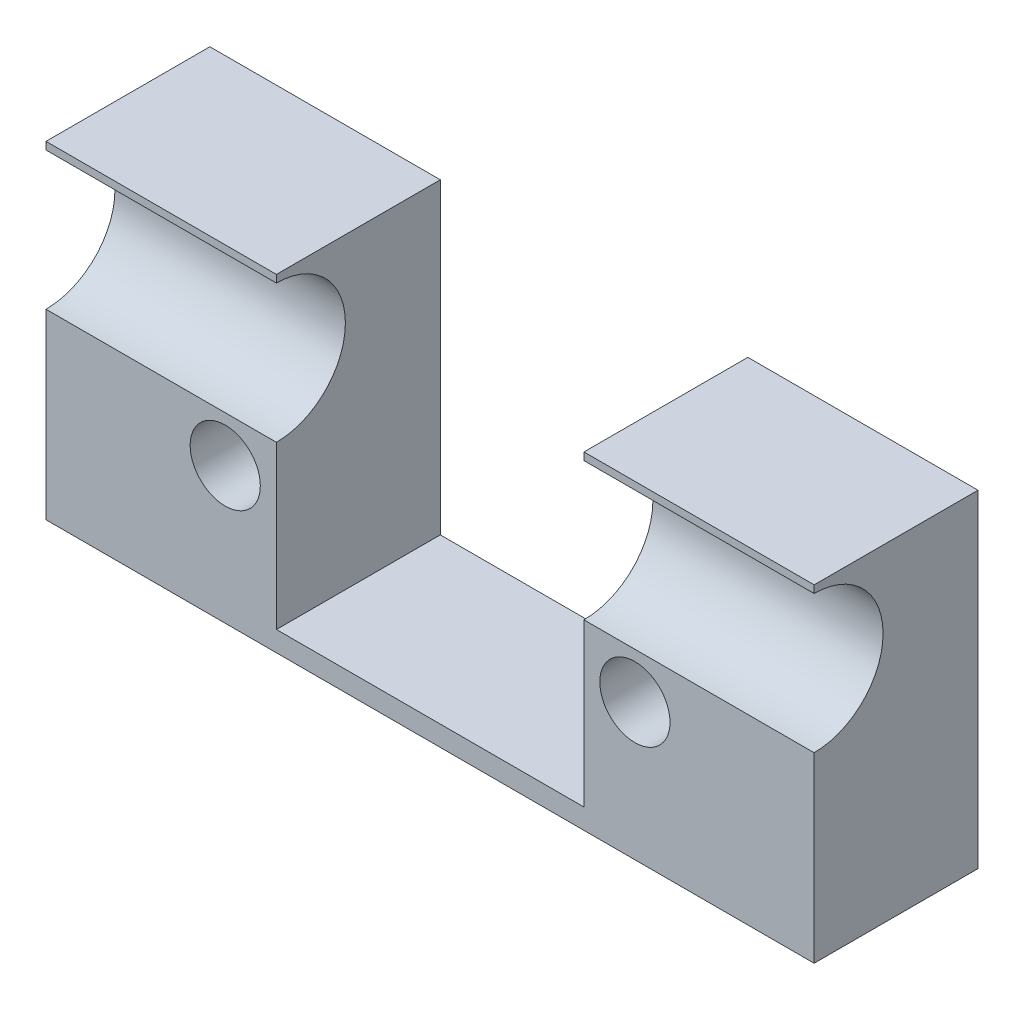
ISO-10303-21;
HEADER;
FILE_DESCRIPTION(('STEP AP214'),'2;1');
FILE_NAME('part.step','',(''),(''),'','','');
FILE_SCHEMA(('AUTOMOTIVE_DESIGN { 1 0 10303 214 1 1 1 1 }'));
ENDSEC;
DATA;
#1=APPLICATION_CONTEXT('core data for automotive mechanical design processes');
#2=APPLICATION_PROTOCOL_DEFINITION('international standard','automotive_design',2000,#1);
#3=PRODUCT_CONTEXT('',#1,'mechanical');
#4=PRODUCT('Part','Part','',(#3));
#5=PRODUCT_RELATED_PRODUCT_CATEGORY('part','',(#4));
#6=PRODUCT_DEFINITION_FORMATION('','',#4);
#7=PRODUCT_DEFINITION_CONTEXT('part definition',#1,'design');
#8=PRODUCT_DEFINITION('design','',#6,#7);
#9=PRODUCT_DEFINITION_SHAPE('','',#8);
#10=(LENGTH_UNIT() NAMED_UNIT(*) SI_UNIT(.MILLI.,.METRE.));
#11=(NAMED_UNIT(*) PLANE_ANGLE_UNIT() SI_UNIT($,.RADIAN.));
#12=(NAMED_UNIT(*) SI_UNIT($,.STERADIAN.) SOLID_ANGLE_UNIT());
#13=UNCERTAINTY_MEASURE_WITH_UNIT(LENGTH_MEASURE(1.E-05),#10,'distance_accuracy_value','');
#14=(GEOMETRIC_REPRESENTATION_CONTEXT(3) GLOBAL_UNCERTAINTY_ASSIGNED_CONTEXT((#13)) GLOBAL_UNIT_ASSIGNED_CONTEXT((#10,
#11,#12)) REPRESENTATION_CONTEXT('',''));
#15=CARTESIAN_POINT('',(0.,0.,0.));
#16=DIRECTION('',(0.,0.,1.));
#17=DIRECTION('',(1.,0.,0.));
#18=AXIS2_PLACEMENT_3D('',#15,#16,#17);
#19=CARTESIAN_POINT('',(0.,0.,0.));
#20=DIRECTION('',(0.,0.,1.));
#21=DIRECTION('',(1.,0.,0.));
#22=AXIS2_PLACEMENT_3D('',#19,#20,#21);
#23=PLANE('',#22);
#24=DIRECTION('',(0.,-1.,0.));
#25=VECTOR('',#24,1.);
#26=CARTESIAN_POINT('',(35.71875,0.,0.));
#27=LINE('',#26,#25);
#28=CARTESIAN_POINT('',(35.71875,30.48,0.));
#29=VERTEX_POINT('',#28);
#30=CARTESIAN_POINT('',(35.71875,29.7794062900681,0.));
#31=VERTEX_POINT('',#30);
#32=EDGE_CURVE('E210',#29,#31,#27,.T.);
#33=ORIENTED_EDGE('',*,*,#32,.F.);
#34=DIRECTION('',(-1.,0.,0.));
#35=VECTOR('',#34,1.);
#36=CARTESIAN_POINT('',(0.,30.48,0.));
#37=LINE('',#36,#35);
#38=CARTESIAN_POINT('',(14.3129,30.48,0.));
#39=VERTEX_POINT('',#38);
#40=EDGE_CURVE('E218',#29,#39,#37,.T.);
#41=ORIENTED_EDGE('',*,*,#40,.T.);
#42=DIRECTION('',(0.,-1.,0.));
#43=VECTOR('',#42,1.);
#44=CARTESIAN_POINT('',(14.3129,30.48,0.));
#45=LINE('',#44,#43);
#46=CARTESIAN_POINT('',(14.3129,29.7794062900681,0.));
#47=VERTEX_POINT('',#46);
#48=EDGE_CURVE('E222',#39,#47,#45,.T.);
#49=ORIENTED_EDGE('',*,*,#48,.T.);
#50=DIRECTION('',(1.,0.,0.));
#51=VECTOR('',#50,1.);
#52=CARTESIAN_POINT('',(-38.4492499999999,29.7794062900681,0.));
#53=LINE('',#52,#51);
#54=EDGE_CURVE('E157',#47,#31,#53,.T.);
#55=ORIENTED_EDGE('',*,*,#54,.T.);
#56=EDGE_LOOP('',(#33,#41,#49,#55));
#57=FACE_BOUND('',#56,.T.);
#58=ADVANCED_FACE('F40',(#57),#23,.T.);
#59=DIRECTION('',(0.,1.,0.));
#60=VECTOR('',#59,1.);
#61=CARTESIAN_POINT('',(-14.2875,30.48,0.));
#62=LINE('',#61,#60);
#63=CARTESIAN_POINT('',(-14.2875,29.7794062900681,0.));
#64=VERTEX_POINT('',#63);
#65=CARTESIAN_POINT('',(-14.2875,30.48,0.));
#66=VERTEX_POINT('',#65);
#67=EDGE_CURVE('E135',#64,#66,#62,.T.);
#68=ORIENTED_EDGE('',*,*,#67,.T.);
#69=DIRECTION('',(-1.,0.,0.));
#70=VECTOR('',#69,1.);
#71=CARTESIAN_POINT('',(0.,30.48,0.));
#72=LINE('',#71,#70);
#73=CARTESIAN_POINT('',(-35.71875,30.48,0.));
#74=VERTEX_POINT('',#73);
#75=EDGE_CURVE('E212',#66,#74,#72,.T.);
#76=ORIENTED_EDGE('',*,*,#75,.T.);
#77=DIRECTION('',(0.,-1.,0.));
#78=VECTOR('',#77,1.);
#79=CARTESIAN_POINT('',(-35.71875,30.48,0.));
#80=LINE('',#79,#78);
#81=CARTESIAN_POINT('',(-35.71875,29.7794062900681,0.));
#82=VERTEX_POINT('',#81);
#83=EDGE_CURVE('E215',#74,#82,#80,.T.);
#84=ORIENTED_EDGE('',*,*,#83,.T.);
#85=DIRECTION('',(1.,0.,0.));
#86=VECTOR('',#85,1.);
#87=CARTESIAN_POINT('',(-38.4492499999999,29.7794062900681,0.));
#88=LINE('',#87,#86);
#89=EDGE_CURVE('E158',#82,#64,#88,.T.);
#90=ORIENTED_EDGE('',*,*,#89,.T.);
#91=EDGE_LOOP('',(#68,#76,#84,#90));
#92=FACE_BOUND('',#91,.T.);
#93=ADVANCED_FACE('F264',(#92),#23,.T.);
#94=CARTESIAN_POINT('',(35.71875,16.9565937099319,0.));
#95=VERTEX_POINT('',#94);
#96=CARTESIAN_POINT('',(35.71875,0.,0.));
#97=VERTEX_POINT('',#96);
#98=EDGE_CURVE('E209',#95,#97,#27,.T.);
#99=ORIENTED_EDGE('',*,*,#98,.F.);
#100=DIRECTION('',(1.,0.,0.));
#101=VECTOR('',#100,1.);
#102=CARTESIAN_POINT('',(-38.4492499999999,16.9565937099319,0.));
#103=LINE('',#102,#101);
#104=CARTESIAN_POINT('',(14.3129,16.9565937099319,0.));
#105=VERTEX_POINT('',#104);
#106=EDGE_CURVE('E161',#95,#105,#103,.F.);
#107=ORIENTED_EDGE('',*,*,#106,.T.);
#108=CARTESIAN_POINT('',(14.3129,1.8796,0.));
#109=VERTEX_POINT('',#108);
#110=EDGE_CURVE('E223',#105,#109,#45,.T.);
#111=ORIENTED_EDGE('',*,*,#110,.T.);
#112=DIRECTION('',(-1.,0.,0.));
#113=VECTOR('',#112,1.);
#114=CARTESIAN_POINT('',(-14.2875,1.8796,0.));
#115=LINE('',#114,#113);
#116=CARTESIAN_POINT('',(-14.2875,1.8796,0.));
#117=VERTEX_POINT('',#116);
#118=EDGE_CURVE('E153',#109,#117,#115,.T.);
#119=ORIENTED_EDGE('',*,*,#118,.T.);
#120=CARTESIAN_POINT('',(-14.2875,16.9565937099319,0.));
#121=VERTEX_POINT('',#120);
#122=EDGE_CURVE('E133',#117,#121,#62,.T.);
#123=ORIENTED_EDGE('',*,*,#122,.T.);
#124=DIRECTION('',(1.,0.,0.));
#125=VECTOR('',#124,1.);
#126=CARTESIAN_POINT('',(-38.4492499999999,16.9565937099319,0.));
#127=LINE('',#126,#125);
#128=CARTESIAN_POINT('',(-35.71875,16.9565937099319,0.));
#129=VERTEX_POINT('',#128);
#130=EDGE_CURVE('E150',#121,#129,#127,.F.);
#131=ORIENTED_EDGE('',*,*,#130,.T.);
#132=CARTESIAN_POINT('',(-35.71875,0.,0.));
#133=VERTEX_POINT('',#132);
#134=EDGE_CURVE('E216',#129,#133,#80,.T.);
#135=ORIENTED_EDGE('',*,*,#134,.T.);
#136=DIRECTION('',(-1.,0.,0.));
#137=VECTOR('',#136,1.);
#138=CARTESIAN_POINT('',(0.,0.,0.));
#139=LINE('',#138,#137);
#140=EDGE_CURVE('E174',#97,#133,#139,.T.);
#141=ORIENTED_EDGE('',*,*,#140,.F.);
#142=EDGE_LOOP('',(#99,#107,#111,#119,#123,#131,#135,#141));
#143=FACE_BOUND('',#142,.T.);
#144=CARTESIAN_POINT('',(19.05,12.7,0.));
#145=DIRECTION('',(0.,0.,1.));
#146=DIRECTION('',(1.,0.,0.));
#147=AXIS2_PLACEMENT_3D('',#144,#145,#146);
#148=CIRCLE('',#147,3.26389999999999);
#149=CARTESIAN_POINT('',(22.3139,12.7,0.));
#150=VERTEX_POINT('',#149);
#151=EDGE_CURVE('E169',#150,#150,#148,.F.);
#152=ORIENTED_EDGE('',*,*,#151,.T.);
#153=EDGE_LOOP('',(#152));
#154=FACE_BOUND('',#153,.T.);
#155=CARTESIAN_POINT('',(-19.05,12.7,0.));
#156=DIRECTION('',(0.,0.,1.));
#157=DIRECTION('',(1.,0.,0.));
#158=AXIS2_PLACEMENT_3D('',#155,#156,#157);
#159=CIRCLE('',#158,3.26389999999999);
#160=CARTESIAN_POINT('',(-15.7861,12.7,0.));
#161=VERTEX_POINT('',#160);
#162=EDGE_CURVE('E163',#161,#161,#159,.F.);
#163=ORIENTED_EDGE('',*,*,#162,.T.);
#164=EDGE_LOOP('',(#163));
#165=FACE_BOUND('',#164,.T.);
#166=ADVANCED_FACE('F147',(#143,#154,#165),#23,.T.);
#167=CARTESIAN_POINT('',(0.,30.48,0.));
#168=DIRECTION('',(0.,-1.,0.));
#169=DIRECTION('',(0.,0.,-1.));
#170=AXIS2_PLACEMENT_3D('',#167,#168,#169);
#171=PLANE('',#170);
#172=ORIENTED_EDGE('',*,*,#75,.F.);
#173=DIRECTION('',(0.,0.,-1.));
#174=VECTOR('',#173,1.);
#175=CARTESIAN_POINT('',(-14.2875,30.48,0.));
#176=LINE('',#175,#174);
#177=CARTESIAN_POINT('',(-14.2875,30.48,-15.24));
#178=VERTEX_POINT('',#177);
#179=EDGE_CURVE('E172',#66,#178,#176,.T.);
#180=ORIENTED_EDGE('',*,*,#179,.T.);
#181=DIRECTION('',(-1.,0.,0.));
#182=VECTOR('',#181,1.);
#183=CARTESIAN_POINT('',(-35.71875,30.48,-15.24));
#184=LINE('',#183,#182);
#185=CARTESIAN_POINT('',(-35.71875,30.48,-15.24));
#186=VERTEX_POINT('',#185);
#187=EDGE_CURVE('E184',#178,#186,#184,.T.);
#188=ORIENTED_EDGE('',*,*,#187,.T.);
#189=DIRECTION('',(0.,0.,1.));
#190=VECTOR('',#189,1.);
#191=CARTESIAN_POINT('',(-35.71875,30.48,15.24));
#192=LINE('',#191,#190);
#193=EDGE_CURVE('E177',#186,#74,#192,.T.);
#194=ORIENTED_EDGE('',*,*,#193,.T.);
#195=EDGE_LOOP('',(#172,#180,#188,#194));
#196=FACE_BOUND('',#195,.T.);
#197=ADVANCED_FACE('F262',(#196),#171,.F.);
#198=CARTESIAN_POINT('',(-14.2875,1.8796,-16.256));
#199=DIRECTION('',(0.,-1.,0.));
#200=DIRECTION('',(0.,0.,-1.));
#201=AXIS2_PLACEMENT_3D('',#198,#199,#200);
#202=PLANE('',#201);
#203=ORIENTED_EDGE('',*,*,#118,.F.);
#204=DIRECTION('',(0.,0.,1.));
#205=VECTOR('',#204,1.);
#206=CARTESIAN_POINT('',(14.3129,1.8796,-16.256));
#207=LINE('',#206,#205);
#208=CARTESIAN_POINT('',(14.3129,1.8796,-15.24));
#209=VERTEX_POINT('',#208);
#210=EDGE_CURVE('E191',#209,#109,#207,.T.);
#211=ORIENTED_EDGE('',*,*,#210,.F.);
#212=DIRECTION('',(1.,0.,0.));
#213=VECTOR('',#212,1.);
#214=CARTESIAN_POINT('',(-35.71875,1.8796,-15.24));
#215=LINE('',#214,#213);
#216=CARTESIAN_POINT('',(-14.2875,1.8796,-15.24));
#217=VERTEX_POINT('',#216);
#218=EDGE_CURVE('E190',#217,#209,#215,.T.);
#219=ORIENTED_EDGE('',*,*,#218,.F.);
#220=DIRECTION('',(0.,0.,1.));
#221=VECTOR('',#220,1.);
#222=CARTESIAN_POINT('',(-14.2875,1.8796,-16.256));
#223=LINE('',#222,#221);
#224=EDGE_CURVE('E193',#217,#117,#223,.T.);
#225=ORIENTED_EDGE('',*,*,#224,.T.);
#226=EDGE_LOOP('',(#203,#211,#219,#225));
#227=FACE_BOUND('',#226,.T.);
#228=ADVANCED_FACE('F230',(#227),#202,.F.);
#229=CARTESIAN_POINT('',(-35.71875,30.48,-15.24));
#230=DIRECTION('',(0.,0.,1.));
#231=DIRECTION('',(1.,0.,0.));
#232=AXIS2_PLACEMENT_3D('',#229,#230,#231);
#233=PLANE('',#232);
#234=CARTESIAN_POINT('',(19.05,12.7,-15.24));
#235=DIRECTION('',(0.,0.,-1.));
#236=DIRECTION('',(-1.,0.,0.));
#237=AXIS2_PLACEMENT_3D('',#234,#235,#236);
#238=CIRCLE('',#237,3.26389999999999);
#239=CARTESIAN_POINT('',(15.7861,12.7,-15.24));
#240=VERTEX_POINT('',#239);
#241=EDGE_CURVE('E11',#240,#240,#238,.T.);
#242=ORIENTED_EDGE('',*,*,#241,.F.);
#243=EDGE_LOOP('',(#242));
#244=FACE_BOUND('',#243,.T.);
#245=CARTESIAN_POINT('',(-19.05,12.7,-15.24));
#246=DIRECTION('',(0.,0.,-1.));
#247=DIRECTION('',(-1.,0.,0.));
#248=AXIS2_PLACEMENT_3D('',#245,#246,#247);
#249=CIRCLE('',#248,3.26389999999999);
#250=CARTESIAN_POINT('',(-22.3139,12.7,-15.24));
#251=VERTEX_POINT('',#250);
#252=EDGE_CURVE('E49',#251,#251,#249,.T.);
#253=ORIENTED_EDGE('',*,*,#252,.F.);
#254=EDGE_LOOP('',(#253));
#255=FACE_BOUND('',#254,.T.);
#256=ORIENTED_EDGE('',*,*,#187,.F.);
#257=DIRECTION('',(0.,-1.,0.));
#258=VECTOR('',#257,1.);
#259=CARTESIAN_POINT('',(-14.2875,30.48,-15.24));
#260=LINE('',#259,#258);
#261=EDGE_CURVE('E233',#178,#217,#260,.T.);
#262=ORIENTED_EDGE('',*,*,#261,.T.);
#263=ORIENTED_EDGE('',*,*,#218,.T.);
#264=DIRECTION('',(0.,1.,0.));
#265=VECTOR('',#264,1.);
#266=CARTESIAN_POINT('',(14.3129,30.48,-15.24));
#267=LINE('',#266,#265);
#268=CARTESIAN_POINT('',(14.3129,30.48,-15.24));
#269=VERTEX_POINT('',#268);
#270=EDGE_CURVE('E57',#209,#269,#267,.T.);
#271=ORIENTED_EDGE('',*,*,#270,.T.);
#272=CARTESIAN_POINT('',(35.71875,30.48,-15.24));
#273=VERTEX_POINT('',#272);
#274=EDGE_CURVE('E179',#273,#269,#184,.T.);
#275=ORIENTED_EDGE('',*,*,#274,.F.);
#276=DIRECTION('',(0.,-1.,0.));
#277=VECTOR('',#276,1.);
#278=CARTESIAN_POINT('',(35.71875,30.48,-15.24));
#279=LINE('',#278,#277);
#280=CARTESIAN_POINT('',(35.71875,0.,-15.24));
#281=VERTEX_POINT('',#280);
#282=EDGE_CURVE('E176',#273,#281,#279,.T.);
#283=ORIENTED_EDGE('',*,*,#282,.T.);
#284=DIRECTION('',(-1.,0.,0.));
#285=VECTOR('',#284,1.);
#286=CARTESIAN_POINT('',(-35.71875,0.,-15.24));
#287=LINE('',#286,#285);
#288=CARTESIAN_POINT('',(-35.71875,0.,-15.24));
#289=VERTEX_POINT('',#288);
#290=EDGE_CURVE('E187',#281,#289,#287,.T.);
#291=ORIENTED_EDGE('',*,*,#290,.T.);
#292=DIRECTION('',(0.,-1.,0.));
#293=VECTOR('',#292,1.);
#294=CARTESIAN_POINT('',(-35.71875,30.48,-15.24));
#295=LINE('',#294,#293);
#296=EDGE_CURVE('E180',#186,#289,#295,.T.);
#297=ORIENTED_EDGE('',*,*,#296,.F.);
#298=EDGE_LOOP('',(#256,#262,#263,#271,#275,#283,#291,#297));
#299=FACE_BOUND('',#298,.T.);
#300=ADVANCED_FACE('F236',(#244,#255,#299),#233,.F.);
#301=CARTESIAN_POINT('',(19.05,12.7,-15.24));
#302=DIRECTION('',(0.,0.,-1.));
#303=DIRECTION('',(-1.,0.,0.));
#304=AXIS2_PLACEMENT_3D('',#301,#302,#303);
#305=CYLINDRICAL_SURFACE('',#304,3.26389999999999);
#306=ORIENTED_EDGE('',*,*,#241,.T.);
#307=EDGE_LOOP('',(#306));
#308=FACE_BOUND('',#307,.T.);
#309=ORIENTED_EDGE('',*,*,#151,.F.);
#310=EDGE_LOOP('',(#309));
#311=FACE_BOUND('',#310,.T.);
#312=ADVANCED_FACE('F290',(#308,#311),#305,.F.);
#313=CARTESIAN_POINT('',(-19.05,12.7,-15.24));
#314=DIRECTION('',(0.,0.,-1.));
#315=DIRECTION('',(-1.,0.,0.));
#316=AXIS2_PLACEMENT_3D('',#313,#314,#315);
#317=CYLINDRICAL_SURFACE('',#316,3.26389999999999);
#318=ORIENTED_EDGE('',*,*,#252,.T.);
#319=EDGE_LOOP('',(#318));
#320=FACE_BOUND('',#319,.T.);
#321=ORIENTED_EDGE('',*,*,#162,.F.);
#322=EDGE_LOOP('',(#321));
#323=FACE_BOUND('',#322,.T.);
#324=ADVANCED_FACE('F283',(#320,#323),#317,.F.);
#325=ORIENTED_EDGE('',*,*,#40,.F.);
#326=DIRECTION('',(0.,0.,-1.));
#327=VECTOR('',#326,1.);
#328=CARTESIAN_POINT('',(35.71875,30.48,15.24));
#329=LINE('',#328,#327);
#330=EDGE_CURVE('E181',#29,#273,#329,.T.);
#331=ORIENTED_EDGE('',*,*,#330,.T.);
#332=ORIENTED_EDGE('',*,*,#274,.T.);
#333=DIRECTION('',(0.,0.,1.));
#334=VECTOR('',#333,1.);
#335=CARTESIAN_POINT('',(14.3129,30.48,0.));
#336=LINE('',#335,#334);
#337=EDGE_CURVE('E62',#269,#39,#336,.T.);
#338=ORIENTED_EDGE('',*,*,#337,.T.);
#339=EDGE_LOOP('',(#325,#331,#332,#338));
#340=FACE_BOUND('',#339,.T.);
#341=ADVANCED_FACE('F276',(#340),#171,.F.);
#342=CARTESIAN_POINT('',(14.3129,30.48,-16.256));
#343=DIRECTION('',(1.,0.,0.));
#344=DIRECTION('',(0.,1.,0.));
#345=AXIS2_PLACEMENT_3D('',#342,#343,#344);
#346=PLANE('',#345);
#347=ORIENTED_EDGE('',*,*,#48,.F.);
#348=ORIENTED_EDGE('',*,*,#337,.F.);
#349=ORIENTED_EDGE('',*,*,#270,.F.);
#350=ORIENTED_EDGE('',*,*,#210,.T.);
#351=ORIENTED_EDGE('',*,*,#110,.F.);
#352=CARTESIAN_POINT('',(14.3129,23.368,0.));
#353=DIRECTION('',(1.,0.,0.));
#354=DIRECTION('',(0.,1.,0.));
#355=AXIS2_PLACEMENT_3D('',#352,#353,#354);
#356=CIRCLE('',#355,6.4114062900681);
#357=EDGE_CURVE('E140',#105,#47,#356,.T.);
#358=ORIENTED_EDGE('',*,*,#357,.T.);
#359=EDGE_LOOP('',(#347,#348,#349,#350,#351,#358));
#360=FACE_BOUND('',#359,.T.);
#361=ADVANCED_FACE('F227',(#360),#346,.F.);
#362=CARTESIAN_POINT('',(-38.4492499999999,23.368,0.));
#363=DIRECTION('',(1.,0.,0.));
#364=DIRECTION('',(0.,0.,-1.));
#365=AXIS2_PLACEMENT_3D('',#362,#363,#364);
#366=CYLINDRICAL_SURFACE('',#365,6.4114062900681);
#367=ORIENTED_EDGE('',*,*,#106,.F.);
#368=CARTESIAN_POINT('',(35.71875,23.368,0.));
#369=DIRECTION('',(1.,0.,0.));
#370=DIRECTION('',(0.,0.,-1.));
#371=AXIS2_PLACEMENT_3D('',#368,#369,#370);
#372=CIRCLE('',#371,6.4114062900681);
#373=EDGE_CURVE('E44',#95,#31,#372,.T.);
#374=ORIENTED_EDGE('',*,*,#373,.T.);
#375=ORIENTED_EDGE('',*,*,#54,.F.);
#376=ORIENTED_EDGE('',*,*,#357,.F.);
#377=EDGE_LOOP('',(#367,#374,#375,#376));
#378=FACE_BOUND('',#377,.T.);
#379=ADVANCED_FACE('F226',(#378),#366,.F.);
#380=CARTESIAN_POINT('',(-35.71875,30.48,15.24));
#381=DIRECTION('',(1.,0.,0.));
#382=DIRECTION('',(0.,0.,-1.));
#383=AXIS2_PLACEMENT_3D('',#380,#381,#382);
#384=PLANE('',#383);
#385=ORIENTED_EDGE('',*,*,#83,.F.);
#386=ORIENTED_EDGE('',*,*,#193,.F.);
#387=ORIENTED_EDGE('',*,*,#296,.T.);
#388=DIRECTION('',(0.,0.,1.));
#389=VECTOR('',#388,1.);
#390=CARTESIAN_POINT('',(-35.71875,0.,15.24));
#391=LINE('',#390,#389);
#392=EDGE_CURVE('E183',#289,#133,#391,.T.);
#393=ORIENTED_EDGE('',*,*,#392,.T.);
#394=ORIENTED_EDGE('',*,*,#134,.F.);
#395=CARTESIAN_POINT('',(-35.71875,23.368,0.));
#396=DIRECTION('',(1.,0.,0.));
#397=DIRECTION('',(0.,0.,-1.));
#398=AXIS2_PLACEMENT_3D('',#395,#396,#397);
#399=CIRCLE('',#398,6.4114062900681);
#400=EDGE_CURVE('E141',#129,#82,#399,.T.);
#401=ORIENTED_EDGE('',*,*,#400,.T.);
#402=EDGE_LOOP('',(#385,#386,#387,#393,#394,#401));
#403=FACE_BOUND('',#402,.T.);
#404=ADVANCED_FACE('F257',(#403),#384,.F.);
#405=CARTESIAN_POINT('',(-14.2875,30.48,-16.256));
#406=DIRECTION('',(-1.,0.,0.));
#407=DIRECTION('',(0.,-1.,0.));
#408=AXIS2_PLACEMENT_3D('',#405,#406,#407);
#409=PLANE('',#408);
#410=ORIENTED_EDGE('',*,*,#122,.F.);
#411=ORIENTED_EDGE('',*,*,#224,.F.);
#412=ORIENTED_EDGE('',*,*,#261,.F.);
#413=ORIENTED_EDGE('',*,*,#179,.F.);
#414=ORIENTED_EDGE('',*,*,#67,.F.);
#415=CARTESIAN_POINT('',(-14.2875,23.368,0.));
#416=DIRECTION('',(-1.,0.,0.));
#417=DIRECTION('',(0.,-1.,0.));
#418=AXIS2_PLACEMENT_3D('',#415,#416,#417);
#419=CIRCLE('',#418,6.4114062900681);
#420=EDGE_CURVE('E129',#64,#121,#419,.T.);
#421=ORIENTED_EDGE('',*,*,#420,.T.);
#422=EDGE_LOOP('',(#410,#411,#412,#413,#414,#421));
#423=FACE_BOUND('',#422,.T.);
#424=ADVANCED_FACE('F131',(#423),#409,.F.);
#425=ORIENTED_EDGE('',*,*,#130,.F.);
#426=ORIENTED_EDGE('',*,*,#420,.F.);
#427=ORIENTED_EDGE('',*,*,#89,.F.);
#428=ORIENTED_EDGE('',*,*,#400,.F.);
#429=EDGE_LOOP('',(#425,#426,#427,#428));
#430=FACE_BOUND('',#429,.T.);
#431=ADVANCED_FACE('F155',(#430),#366,.F.);
#432=CARTESIAN_POINT('',(0.,0.,0.));
#433=DIRECTION('',(0.,-1.,0.));
#434=DIRECTION('',(0.,0.,-1.));
#435=AXIS2_PLACEMENT_3D('',#432,#433,#434);
#436=PLANE('',#435);
#437=DIRECTION('',(0.,0.,-1.));
#438=VECTOR('',#437,1.);
#439=CARTESIAN_POINT('',(35.71875,0.,15.24));
#440=LINE('',#439,#438);
#441=EDGE_CURVE('E188',#97,#281,#440,.T.);
#442=ORIENTED_EDGE('',*,*,#441,.F.);
#443=ORIENTED_EDGE('',*,*,#140,.T.);
#444=ORIENTED_EDGE('',*,*,#392,.F.);
#445=ORIENTED_EDGE('',*,*,#290,.F.);
#446=EDGE_LOOP('',(#442,#443,#444,#445));
#447=FACE_BOUND('',#446,.T.);
#448=ADVANCED_FACE('F254',(#447),#436,.T.);
#449=CARTESIAN_POINT('',(35.71875,30.48,15.24));
#450=DIRECTION('',(-1.,0.,0.));
#451=DIRECTION('',(0.,0.,1.));
#452=AXIS2_PLACEMENT_3D('',#449,#450,#451);
#453=PLANE('',#452);
#454=ORIENTED_EDGE('',*,*,#330,.F.);
#455=ORIENTED_EDGE('',*,*,#32,.T.);
#456=ORIENTED_EDGE('',*,*,#373,.F.);
#457=ORIENTED_EDGE('',*,*,#98,.T.);
#458=ORIENTED_EDGE('',*,*,#441,.T.);
#459=ORIENTED_EDGE('',*,*,#282,.F.);
#460=EDGE_LOOP('',(#454,#455,#456,#457,#458,#459));
#461=FACE_BOUND('',#460,.T.);
#462=ADVANCED_FACE('F42',(#461),#453,.F.);
#463=CLOSED_SHELL('',(#58,#93,#166,#197,#228,#300,#312,#324,#341,#361,#379,#404,#424,#431,#448,#462));
#464=MANIFOLD_SOLID_BREP('B2',#463);
#465=ADVANCED_BREP_SHAPE_REPRESENTATION('',(#18,#464),#14);
#466=SHAPE_DEFINITION_REPRESENTATION(#9,#465);
ENDSEC;
END-ISO-10303-21;
